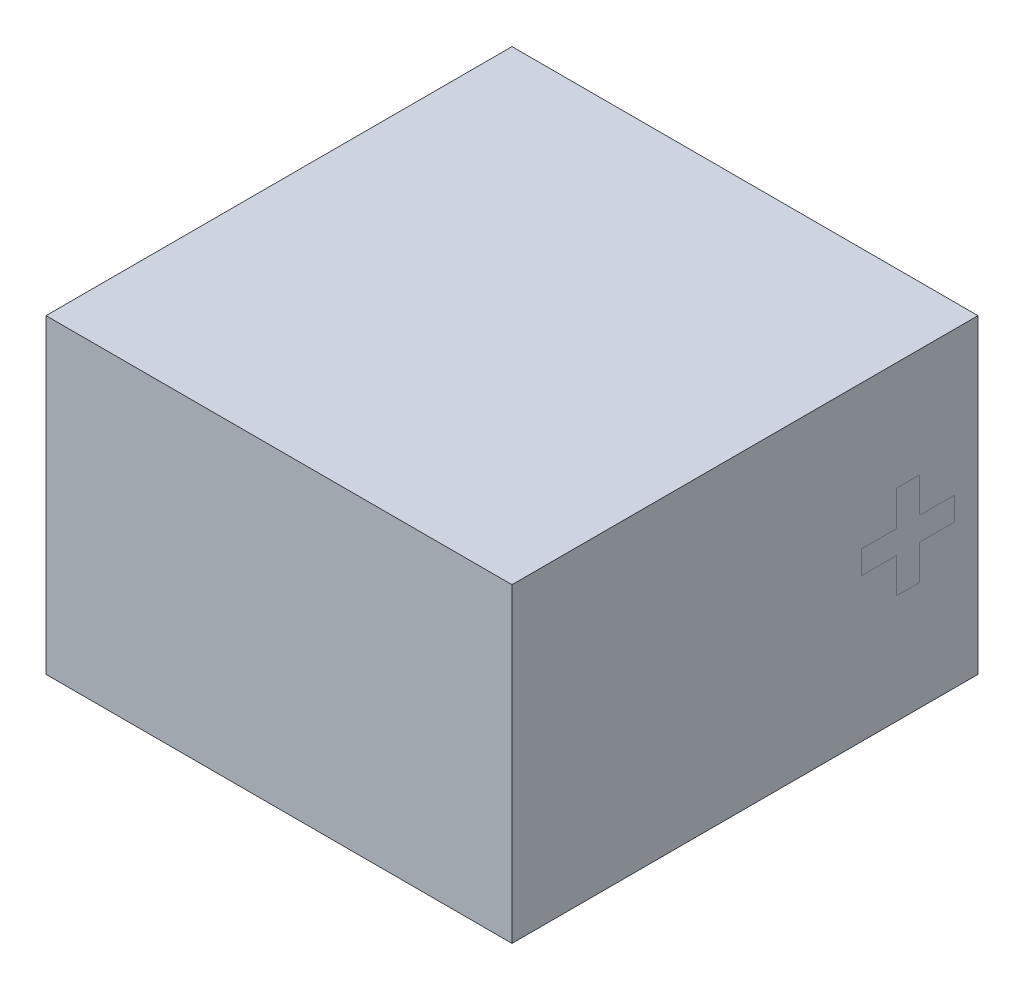
ISO-10303-21;
HEADER;
FILE_DESCRIPTION(('STEP AP214'),'2;1');
FILE_NAME('part.step','',(''),(''),'','','');
FILE_SCHEMA(('AUTOMOTIVE_DESIGN { 1 0 10303 214 1 1 1 1 }'));
ENDSEC;
DATA;
#1=APPLICATION_CONTEXT('core data for automotive mechanical design processes');
#2=APPLICATION_PROTOCOL_DEFINITION('international standard','automotive_design',2000,#1);
#3=PRODUCT_CONTEXT('',#1,'mechanical');
#4=PRODUCT('Part','Part','',(#3));
#5=PRODUCT_RELATED_PRODUCT_CATEGORY('part','',(#4));
#6=PRODUCT_DEFINITION_FORMATION('','',#4);
#7=PRODUCT_DEFINITION_CONTEXT('part definition',#1,'design');
#8=PRODUCT_DEFINITION('design','',#6,#7);
#9=PRODUCT_DEFINITION_SHAPE('','',#8);
#10=(LENGTH_UNIT() NAMED_UNIT(*) SI_UNIT(.MILLI.,.METRE.));
#11=(NAMED_UNIT(*) PLANE_ANGLE_UNIT() SI_UNIT($,.RADIAN.));
#12=(NAMED_UNIT(*) SI_UNIT($,.STERADIAN.) SOLID_ANGLE_UNIT());
#13=UNCERTAINTY_MEASURE_WITH_UNIT(LENGTH_MEASURE(1.E-05),#10,'distance_accuracy_value','');
#14=(GEOMETRIC_REPRESENTATION_CONTEXT(3) GLOBAL_UNCERTAINTY_ASSIGNED_CONTEXT((#13)) GLOBAL_UNIT_ASSIGNED_CONTEXT((#10,
#11,#12)) REPRESENTATION_CONTEXT('',''));
#15=CARTESIAN_POINT('',(0.,0.,0.));
#16=DIRECTION('',(0.,0.,1.));
#17=DIRECTION('',(1.,0.,0.));
#18=AXIS2_PLACEMENT_3D('',#15,#16,#17);
#19=CARTESIAN_POINT('',(1.5,2.,-1.5));
#20=DIRECTION('',(-1.,0.,0.));
#21=DIRECTION('',(0.,0.,1.));
#22=AXIS2_PLACEMENT_3D('',#19,#20,#21);
#23=PLANE('',#22);
#24=DIRECTION('',(0.,0.,-1.));
#25=VECTOR('',#24,1.);
#26=CARTESIAN_POINT('',(1.5,0.925000000000001,-1.125));
#27=LINE('',#26,#25);
#28=CARTESIAN_POINT('',(1.5,0.925000000000001,-1.125));
#29=VERTEX_POINT('',#28);
#30=CARTESIAN_POINT('',(1.5,0.925000000000001,-1.35));
#31=VERTEX_POINT('',#30);
#32=EDGE_CURVE('E357',#29,#31,#27,.T.);
#33=ORIENTED_EDGE('',*,*,#32,.T.);
#34=DIRECTION('',(0.,1.,0.));
#35=VECTOR('',#34,1.);
#36=CARTESIAN_POINT('',(1.5,1.075,-1.35));
#37=LINE('',#36,#35);
#38=CARTESIAN_POINT('',(1.5,1.075,-1.35));
#39=VERTEX_POINT('',#38);
#40=EDGE_CURVE('E13',#31,#39,#37,.T.);
#41=ORIENTED_EDGE('',*,*,#40,.T.);
#42=DIRECTION('',(0.,0.,1.));
#43=VECTOR('',#42,1.);
#44=CARTESIAN_POINT('',(1.5,1.075,-1.125));
#45=LINE('',#44,#43);
#46=CARTESIAN_POINT('',(1.5,1.075,-1.125));
#47=VERTEX_POINT('',#46);
#48=EDGE_CURVE('E445',#39,#47,#45,.T.);
#49=ORIENTED_EDGE('',*,*,#48,.T.);
#50=DIRECTION('',(0.,1.,0.));
#51=VECTOR('',#50,1.);
#52=CARTESIAN_POINT('',(1.5,1.3,-1.125));
#53=LINE('',#52,#51);
#54=CARTESIAN_POINT('',(1.5,1.3,-1.125));
#55=VERTEX_POINT('',#54);
#56=EDGE_CURVE('E449',#47,#55,#53,.T.);
#57=ORIENTED_EDGE('',*,*,#56,.T.);
#58=DIRECTION('',(0.,0.,1.));
#59=VECTOR('',#58,1.);
#60=CARTESIAN_POINT('',(1.5,1.3,-0.975));
#61=LINE('',#60,#59);
#62=CARTESIAN_POINT('',(1.5,1.3,-0.975));
#63=VERTEX_POINT('',#62);
#64=EDGE_CURVE('E458',#55,#63,#61,.T.);
#65=ORIENTED_EDGE('',*,*,#64,.T.);
#66=DIRECTION('',(0.,-1.,0.));
#67=VECTOR('',#66,1.);
#68=CARTESIAN_POINT('',(1.5,1.3,-0.975));
#69=LINE('',#68,#67);
#70=CARTESIAN_POINT('',(1.5,1.075,-0.975));
#71=VERTEX_POINT('',#70);
#72=EDGE_CURVE('E462',#63,#71,#69,.T.);
#73=ORIENTED_EDGE('',*,*,#72,.T.);
#74=DIRECTION('',(0.,0.,1.));
#75=VECTOR('',#74,1.);
#76=CARTESIAN_POINT('',(1.5,1.075,-0.75));
#77=LINE('',#76,#75);
#78=CARTESIAN_POINT('',(1.5,1.075,-0.75));
#79=VERTEX_POINT('',#78);
#80=EDGE_CURVE('E466',#71,#79,#77,.T.);
#81=ORIENTED_EDGE('',*,*,#80,.T.);
#82=DIRECTION('',(0.,-1.,0.));
#83=VECTOR('',#82,1.);
#84=CARTESIAN_POINT('',(1.5,1.075,-0.75));
#85=LINE('',#84,#83);
#86=CARTESIAN_POINT('',(1.5,0.925000000000001,-0.75));
#87=VERTEX_POINT('',#86);
#88=EDGE_CURVE('E470',#79,#87,#85,.T.);
#89=ORIENTED_EDGE('',*,*,#88,.T.);
#90=DIRECTION('',(0.,0.,-1.));
#91=VECTOR('',#90,1.);
#92=CARTESIAN_POINT('',(1.5,0.925000000000001,-0.75));
#93=LINE('',#92,#91);
#94=CARTESIAN_POINT('',(1.5,0.925000000000001,-0.975));
#95=VERTEX_POINT('',#94);
#96=EDGE_CURVE('E474',#87,#95,#93,.T.);
#97=ORIENTED_EDGE('',*,*,#96,.T.);
#98=DIRECTION('',(0.,-1.,0.));
#99=VECTOR('',#98,1.);
#100=CARTESIAN_POINT('',(1.5,0.925000000000001,-0.975));
#101=LINE('',#100,#99);
#102=CARTESIAN_POINT('',(1.5,0.700000000000001,-0.975));
#103=VERTEX_POINT('',#102);
#104=EDGE_CURVE('E478',#95,#103,#101,.T.);
#105=ORIENTED_EDGE('',*,*,#104,.T.);
#106=DIRECTION('',(0.,0.,-1.));
#107=VECTOR('',#106,1.);
#108=CARTESIAN_POINT('',(1.5,0.700000000000001,-0.975));
#109=LINE('',#108,#107);
#110=CARTESIAN_POINT('',(1.5,0.700000000000001,-1.125));
#111=VERTEX_POINT('',#110);
#112=EDGE_CURVE('E482',#103,#111,#109,.T.);
#113=ORIENTED_EDGE('',*,*,#112,.T.);
#114=DIRECTION('',(0.,1.,0.));
#115=VECTOR('',#114,1.);
#116=CARTESIAN_POINT('',(1.5,0.925000000000001,-1.125));
#117=LINE('',#116,#115);
#118=EDGE_CURVE('E486',#111,#29,#117,.T.);
#119=ORIENTED_EDGE('',*,*,#118,.T.);
#120=EDGE_LOOP('',(#33,#41,#49,#57,#65,#73,#81,#89,#97,#105,#113,#119));
#121=FACE_BOUND('',#120,.T.);
#122=ADVANCED_FACE('F348',(#121),#23,.F.);
#123=CARTESIAN_POINT('',(-1.5,2.,-1.5));
#124=DIRECTION('',(1.,0.,0.));
#125=DIRECTION('',(0.,0.,-1.));
#126=AXIS2_PLACEMENT_3D('',#123,#124,#125);
#127=PLANE('',#126);
#128=DIRECTION('',(0.,0.,1.));
#129=VECTOR('',#128,1.);
#130=CARTESIAN_POINT('',(-1.5,0.,-1.5));
#131=LINE('',#130,#129);
#132=CARTESIAN_POINT('',(-1.5,0.,-1.5));
#133=VERTEX_POINT('',#132);
#134=CARTESIAN_POINT('',(-1.5,0.,1.5));
#135=VERTEX_POINT('',#134);
#136=EDGE_CURVE('E444',#133,#135,#131,.T.);
#137=ORIENTED_EDGE('',*,*,#136,.T.);
#138=DIRECTION('',(0.,-1.,0.));
#139=VECTOR('',#138,1.);
#140=CARTESIAN_POINT('',(-1.5,2.,1.5));
#141=LINE('',#140,#139);
#142=CARTESIAN_POINT('',(-1.5,2.,1.5));
#143=VERTEX_POINT('',#142);
#144=EDGE_CURVE('E425',#143,#135,#141,.T.);
#145=ORIENTED_EDGE('',*,*,#144,.F.);
#146=DIRECTION('',(0.,0.,1.));
#147=VECTOR('',#146,1.);
#148=CARTESIAN_POINT('',(-1.5,2.,-1.5));
#149=LINE('',#148,#147);
#150=CARTESIAN_POINT('',(-1.5,2.,-1.5));
#151=VERTEX_POINT('',#150);
#152=EDGE_CURVE('E432',#151,#143,#149,.T.);
#153=ORIENTED_EDGE('',*,*,#152,.F.);
#154=DIRECTION('',(0.,-1.,0.));
#155=VECTOR('',#154,1.);
#156=CARTESIAN_POINT('',(-1.5,2.,-1.5));
#157=LINE('',#156,#155);
#158=EDGE_CURVE('E506',#151,#133,#157,.T.);
#159=ORIENTED_EDGE('',*,*,#158,.T.);
#160=EDGE_LOOP('',(#137,#145,#153,#159));
#161=FACE_BOUND('',#160,.T.);
#162=ADVANCED_FACE('F350',(#161),#127,.F.);
#163=CARTESIAN_POINT('',(-1.5,2.,1.5));
#164=DIRECTION('',(0.,0.,-1.));
#165=DIRECTION('',(-1.,0.,0.));
#166=AXIS2_PLACEMENT_3D('',#163,#164,#165);
#167=PLANE('',#166);
#168=DIRECTION('',(1.,0.,0.));
#169=VECTOR('',#168,1.);
#170=CARTESIAN_POINT('',(-1.5,0.,1.5));
#171=LINE('',#170,#169);
#172=CARTESIAN_POINT('',(1.5,0.,1.5));
#173=VERTEX_POINT('',#172);
#174=EDGE_CURVE('E503',#135,#173,#171,.T.);
#175=ORIENTED_EDGE('',*,*,#174,.T.);
#176=DIRECTION('',(0.,-1.,0.));
#177=VECTOR('',#176,1.);
#178=CARTESIAN_POINT('',(1.5,2.,1.5));
#179=LINE('',#178,#177);
#180=CARTESIAN_POINT('',(1.5,2.,1.5));
#181=VERTEX_POINT('',#180);
#182=EDGE_CURVE('E428',#181,#173,#179,.T.);
#183=ORIENTED_EDGE('',*,*,#182,.F.);
#184=DIRECTION('',(1.,0.,0.));
#185=VECTOR('',#184,1.);
#186=CARTESIAN_POINT('',(-1.5,2.,1.5));
#187=LINE('',#186,#185);
#188=EDGE_CURVE('E421',#143,#181,#187,.T.);
#189=ORIENTED_EDGE('',*,*,#188,.F.);
#190=ORIENTED_EDGE('',*,*,#144,.T.);
#191=EDGE_LOOP('',(#175,#183,#189,#190));
#192=FACE_BOUND('',#191,.T.);
#193=ADVANCED_FACE('F423',(#192),#167,.F.);
#194=ORIENTED_EDGE('',*,*,#40,.F.);
#195=ORIENTED_EDGE('',*,*,#32,.F.);
#196=ORIENTED_EDGE('',*,*,#118,.F.);
#197=ORIENTED_EDGE('',*,*,#112,.F.);
#198=ORIENTED_EDGE('',*,*,#104,.F.);
#199=ORIENTED_EDGE('',*,*,#96,.F.);
#200=ORIENTED_EDGE('',*,*,#88,.F.);
#201=ORIENTED_EDGE('',*,*,#80,.F.);
#202=ORIENTED_EDGE('',*,*,#72,.F.);
#203=ORIENTED_EDGE('',*,*,#64,.F.);
#204=ORIENTED_EDGE('',*,*,#56,.F.);
#205=ORIENTED_EDGE('',*,*,#48,.F.);
#206=EDGE_LOOP('',(#194,#195,#196,#197,#198,#199,#200,#201,#202,#203,#204,#205));
#207=FACE_BOUND('',#206,.T.);
#208=DIRECTION('',(0.,0.,-1.));
#209=VECTOR('',#208,1.);
#210=CARTESIAN_POINT('',(1.5,0.,-1.5));
#211=LINE('',#210,#209);
#212=CARTESIAN_POINT('',(1.5,0.,-1.5));
#213=VERTEX_POINT('',#212);
#214=EDGE_CURVE('E499',#173,#213,#211,.T.);
#215=ORIENTED_EDGE('',*,*,#214,.T.);
#216=DIRECTION('',(0.,-1.,0.));
#217=VECTOR('',#216,1.);
#218=CARTESIAN_POINT('',(1.5,2.,-1.5));
#219=LINE('',#218,#217);
#220=CARTESIAN_POINT('',(1.5,2.,-1.5));
#221=VERTEX_POINT('',#220);
#222=EDGE_CURVE('E451',#221,#213,#219,.T.);
#223=ORIENTED_EDGE('',*,*,#222,.F.);
#224=DIRECTION('',(0.,0.,-1.));
#225=VECTOR('',#224,1.);
#226=CARTESIAN_POINT('',(1.5,2.,-1.5));
#227=LINE('',#226,#225);
#228=EDGE_CURVE('E431',#181,#221,#227,.T.);
#229=ORIENTED_EDGE('',*,*,#228,.F.);
#230=ORIENTED_EDGE('',*,*,#182,.T.);
#231=EDGE_LOOP('',(#215,#223,#229,#230));
#232=FACE_BOUND('',#231,.T.);
#233=ADVANCED_FACE('F492',(#207,#232),#23,.F.);
#234=CARTESIAN_POINT('',(-1.5,2.,-1.5));
#235=DIRECTION('',(0.,0.,1.));
#236=DIRECTION('',(1.,0.,0.));
#237=AXIS2_PLACEMENT_3D('',#234,#235,#236);
#238=PLANE('',#237);
#239=DIRECTION('',(-1.,0.,0.));
#240=VECTOR('',#239,1.);
#241=CARTESIAN_POINT('',(-1.5,0.,-1.5));
#242=LINE('',#241,#240);
#243=EDGE_CURVE('E441',#213,#133,#242,.T.);
#244=ORIENTED_EDGE('',*,*,#243,.T.);
#245=ORIENTED_EDGE('',*,*,#158,.F.);
#246=DIRECTION('',(-1.,0.,0.));
#247=VECTOR('',#246,1.);
#248=CARTESIAN_POINT('',(-1.5,2.,-1.5));
#249=LINE('',#248,#247);
#250=EDGE_CURVE('E437',#221,#151,#249,.T.);
#251=ORIENTED_EDGE('',*,*,#250,.F.);
#252=ORIENTED_EDGE('',*,*,#222,.T.);
#253=EDGE_LOOP('',(#244,#245,#251,#252));
#254=FACE_BOUND('',#253,.T.);
#255=ADVANCED_FACE('F495',(#254),#238,.F.);
#256=CARTESIAN_POINT('',(0.,2.,0.));
#257=DIRECTION('',(0.,1.,0.));
#258=DIRECTION('',(0.,0.,1.));
#259=AXIS2_PLACEMENT_3D('',#256,#257,#258);
#260=PLANE('',#259);
#261=ORIENTED_EDGE('',*,*,#152,.T.);
#262=ORIENTED_EDGE('',*,*,#188,.T.);
#263=ORIENTED_EDGE('',*,*,#228,.T.);
#264=ORIENTED_EDGE('',*,*,#250,.T.);
#265=EDGE_LOOP('',(#261,#262,#263,#264));
#266=FACE_BOUND('',#265,.T.);
#267=ADVANCED_FACE('F435',(#266),#260,.T.);
#268=CARTESIAN_POINT('',(0.,0.,0.));
#269=DIRECTION('',(0.,1.,0.));
#270=DIRECTION('',(0.,0.,1.));
#271=AXIS2_PLACEMENT_3D('',#268,#269,#270);
#272=PLANE('',#271);
#273=ORIENTED_EDGE('',*,*,#136,.F.);
#274=ORIENTED_EDGE('',*,*,#243,.F.);
#275=ORIENTED_EDGE('',*,*,#214,.F.);
#276=ORIENTED_EDGE('',*,*,#174,.F.);
#277=EDGE_LOOP('',(#273,#274,#275,#276));
#278=FACE_BOUND('',#277,.T.);
#279=ADVANCED_FACE('F507',(#278),#272,.F.);
#280=CLOSED_SHELL('',(#122,#162,#193,#233,#255,#267,#279));
#281=MANIFOLD_SOLID_BREP('B2',#280);
#282=ADVANCED_BREP_SHAPE_REPRESENTATION('',(#18,#281),#14);
#283=SHAPE_DEFINITION_REPRESENTATION(#9,#282);
ENDSEC;
END-ISO-10303-21;
